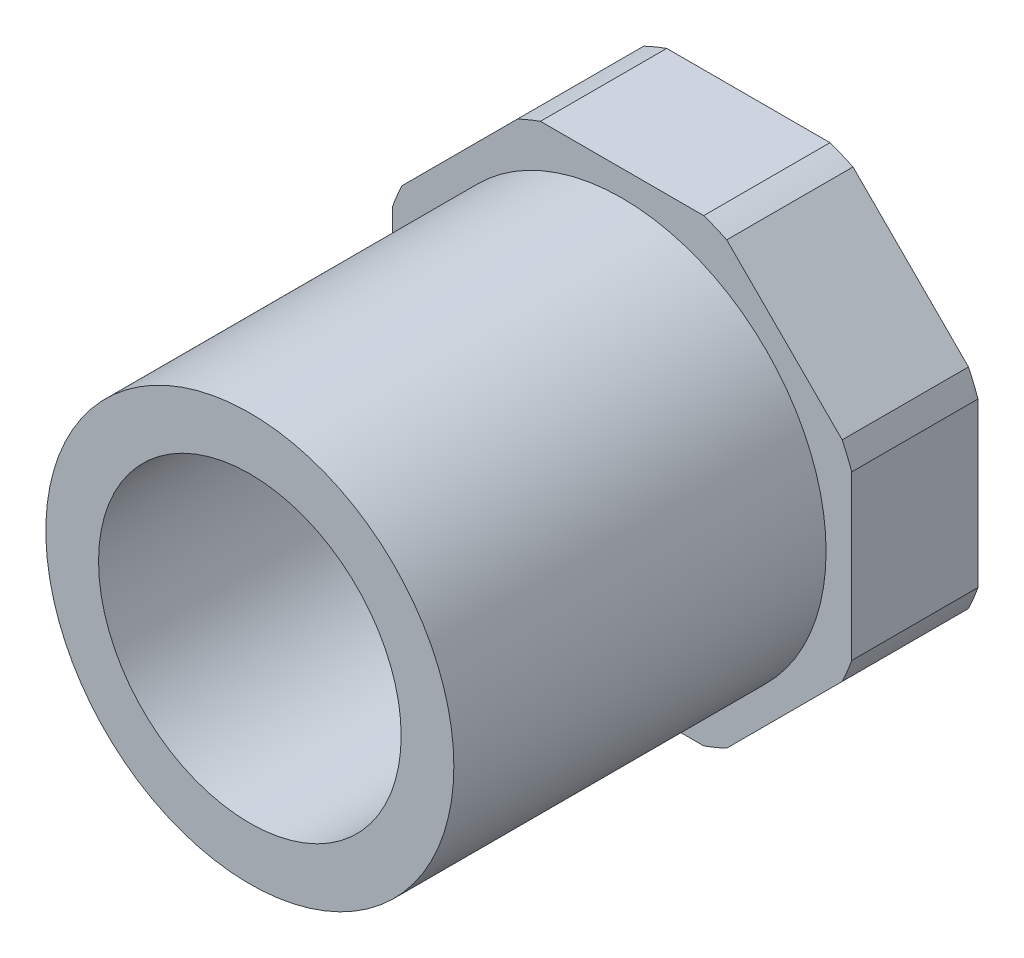
ISO-10303-21;
HEADER;
FILE_DESCRIPTION(('STEP AP214'),'2;1');
FILE_NAME('part.step','',(''),(''),'','','');
FILE_SCHEMA(('AUTOMOTIVE_DESIGN { 1 0 10303 214 1 1 1 1 }'));
ENDSEC;
DATA;
#1=APPLICATION_CONTEXT('core data for automotive mechanical design processes');
#2=APPLICATION_PROTOCOL_DEFINITION('international standard','automotive_design',2000,#1);
#3=PRODUCT_CONTEXT('',#1,'mechanical');
#4=PRODUCT('Part','Part','',(#3));
#5=PRODUCT_RELATED_PRODUCT_CATEGORY('part','',(#4));
#6=PRODUCT_DEFINITION_FORMATION('','',#4);
#7=PRODUCT_DEFINITION_CONTEXT('part definition',#1,'design');
#8=PRODUCT_DEFINITION('design','',#6,#7);
#9=PRODUCT_DEFINITION_SHAPE('','',#8);
#10=(LENGTH_UNIT() NAMED_UNIT(*) SI_UNIT(.MILLI.,.METRE.));
#11=(NAMED_UNIT(*) PLANE_ANGLE_UNIT() SI_UNIT($,.RADIAN.));
#12=(NAMED_UNIT(*) SI_UNIT($,.STERADIAN.) SOLID_ANGLE_UNIT());
#13=UNCERTAINTY_MEASURE_WITH_UNIT(LENGTH_MEASURE(1.E-05),#10,'distance_accuracy_value','');
#14=(GEOMETRIC_REPRESENTATION_CONTEXT(3) GLOBAL_UNCERTAINTY_ASSIGNED_CONTEXT((#13)) GLOBAL_UNIT_ASSIGNED_CONTEXT((#10,
#11,#12)) REPRESENTATION_CONTEXT('',''));
#15=CARTESIAN_POINT('',(0.,0.,0.));
#16=DIRECTION('',(0.,0.,1.));
#17=DIRECTION('',(1.,0.,0.));
#18=AXIS2_PLACEMENT_3D('',#15,#16,#17);
#19=CARTESIAN_POINT('',(0.,0.,13.096875));
#20=DIRECTION('',(0.,0.,1.));
#21=DIRECTION('',(1.,0.,0.));
#22=AXIS2_PLACEMENT_3D('',#19,#20,#21);
#23=CYLINDRICAL_SURFACE('',#22,10.7188);
#24=CARTESIAN_POINT('',(0.,0.,13.096875));
#25=DIRECTION('',(0.,0.,1.));
#26=DIRECTION('',(1.,0.,0.));
#27=AXIS2_PLACEMENT_3D('',#24,#25,#26);
#28=CIRCLE('',#27,10.7188);
#29=CARTESIAN_POINT('',(10.7188,0.,13.096875));
#30=VERTEX_POINT('',#29);
#31=EDGE_CURVE('E178',#30,#30,#28,.T.);
#32=ORIENTED_EDGE('',*,*,#31,.F.);
#33=EDGE_LOOP('',(#32));
#34=FACE_BOUND('',#33,.T.);
#35=CARTESIAN_POINT('',(0.,0.,-6.461125));
#36=DIRECTION('',(0.,0.,-1.));
#37=DIRECTION('',(0.,1.,0.));
#38=AXIS2_PLACEMENT_3D('',#35,#36,#37);
#39=CIRCLE('',#38,10.7188);
#40=CARTESIAN_POINT('',(0.,10.7188,-6.461125));
#41=VERTEX_POINT('',#40);
#42=EDGE_CURVE('E236',#41,#41,#39,.T.);
#43=ORIENTED_EDGE('',*,*,#42,.F.);
#44=EDGE_LOOP('',(#43));
#45=FACE_BOUND('',#44,.T.);
#46=ADVANCED_FACE('F33',(#34,#45),#23,.T.);
#47=CARTESIAN_POINT('',(0.,0.,14.2399258000002));
#48=DIRECTION('',(0.,0.,1.));
#49=DIRECTION('',(0.,-1.,0.));
#50=AXIS2_PLACEMENT_3D('',#47,#48,#49);
#51=SPHERICAL_SURFACE('',#50,20.7010508000002);
#52=CARTESIAN_POINT('',(0.,0.,-4.87362500000002));
#53=DIRECTION('',(0.,0.,1.));
#54=DIRECTION('',(1.,0.,0.));
#55=AXIS2_PLACEMENT_3D('',#52,#53,#54);
#56=CIRCLE('',#55,7.95019999999999);
#57=CARTESIAN_POINT('',(7.95019999999999,0.,-4.87362500000002));
#58=VERTEX_POINT('',#57);
#59=EDGE_CURVE('E183',#58,#58,#56,.T.);
#60=ORIENTED_EDGE('',*,*,#59,.T.);
#61=EDGE_LOOP('',(#60));
#62=FACE_BOUND('',#61,.T.);
#63=ADVANCED_FACE('F35',(#62),#51,.F.);
#64=CARTESIAN_POINT('',(0.,0.,13.096875));
#65=DIRECTION('',(0.,0.,1.));
#66=DIRECTION('',(1.,0.,0.));
#67=AXIS2_PLACEMENT_3D('',#64,#65,#66);
#68=CYLINDRICAL_SURFACE('',#67,7.95019999999999);
#69=CARTESIAN_POINT('',(0.,0.,13.096875));
#70=DIRECTION('',(0.,0.,1.));
#71=DIRECTION('',(1.,0.,0.));
#72=AXIS2_PLACEMENT_3D('',#69,#70,#71);
#73=CIRCLE('',#72,7.95019999999999);
#74=CARTESIAN_POINT('',(7.95019999999999,0.,13.096875));
#75=VERTEX_POINT('',#74);
#76=EDGE_CURVE('E181',#75,#75,#73,.T.);
#77=ORIENTED_EDGE('',*,*,#76,.T.);
#78=EDGE_LOOP('',(#77));
#79=FACE_BOUND('',#78,.T.);
#80=ORIENTED_EDGE('',*,*,#59,.F.);
#81=EDGE_LOOP('',(#80));
#82=FACE_BOUND('',#81,.T.);
#83=ADVANCED_FACE('F331',(#79,#82),#68,.F.);
#84=CARTESIAN_POINT('',(0.,-10.7188,13.096875));
#85=DIRECTION('',(0.,0.,1.));
#86=DIRECTION('',(1.,0.,0.));
#87=AXIS2_PLACEMENT_3D('',#84,#85,#86);
#88=PLANE('',#87);
#89=ORIENTED_EDGE('',*,*,#31,.T.);
#90=EDGE_LOOP('',(#89));
#91=FACE_BOUND('',#90,.T.);
#92=ORIENTED_EDGE('',*,*,#76,.F.);
#93=EDGE_LOOP('',(#92));
#94=FACE_BOUND('',#93,.T.);
#95=ADVANCED_FACE('F337',(#91,#94),#88,.T.);
#96=CARTESIAN_POINT('',(-12.065,4.99748663003139,-6.461125));
#97=DIRECTION('',(-0.707106781186547,0.707106781186548,0.));
#98=DIRECTION('',(-0.707106781186548,-0.707106781186547,0.));
#99=AXIS2_PLACEMENT_3D('',#96,#97,#98);
#100=PLANE('',#99);
#101=DIRECTION('',(0.,0.,-1.));
#102=VECTOR('',#101,1.);
#103=CARTESIAN_POINT('',(-5.49764931005171,11.5648373199796,-6.461125));
#104=LINE('',#103,#102);
#105=CARTESIAN_POINT('',(-5.49764931005171,11.5648373199796,-13.096875));
#106=VERTEX_POINT('',#105);
#107=CARTESIAN_POINT('',(-5.49764931005171,11.5648373199796,-6.461125));
#108=VERTEX_POINT('',#107);
#109=EDGE_CURVE('E255',#106,#108,#104,.F.);
#110=ORIENTED_EDGE('',*,*,#109,.F.);
#111=DIRECTION('',(0.707106781186548,0.707106781186547,0.));
#112=VECTOR('',#111,1.);
#113=CARTESIAN_POINT('',(-12.065,4.99748663003139,-13.096875));
#114=LINE('',#113,#112);
#115=CARTESIAN_POINT('',(-11.5648373199796,5.49764931005173,-13.096875));
#116=VERTEX_POINT('',#115);
#117=EDGE_CURVE('E234',#116,#106,#114,.T.);
#118=ORIENTED_EDGE('',*,*,#117,.F.);
#119=DIRECTION('',(0.,0.,-1.));
#120=VECTOR('',#119,1.);
#121=CARTESIAN_POINT('',(-11.5648373199796,5.49764931005173,-6.461125));
#122=LINE('',#121,#120);
#123=CARTESIAN_POINT('',(-11.5648373199796,5.49764931005173,-6.461125));
#124=VERTEX_POINT('',#123);
#125=EDGE_CURVE('E151',#124,#116,#122,.T.);
#126=ORIENTED_EDGE('',*,*,#125,.F.);
#127=DIRECTION('',(0.707106781186548,0.707106781186547,0.));
#128=VECTOR('',#127,1.);
#129=CARTESIAN_POINT('',(-12.065,4.99748663003139,-6.461125));
#130=LINE('',#129,#128);
#131=EDGE_CURVE('E168',#124,#108,#130,.T.);
#132=ORIENTED_EDGE('',*,*,#131,.T.);
#133=EDGE_LOOP('',(#110,#118,#126,#132));
#134=FACE_BOUND('',#133,.T.);
#135=ADVANCED_FACE('F315',(#134),#100,.T.);
#136=CARTESIAN_POINT('',(-12.065,-4.99748663003137,-6.461125));
#137=DIRECTION('',(-1.,0.,0.));
#138=DIRECTION('',(0.,-1.,0.));
#139=AXIS2_PLACEMENT_3D('',#136,#137,#138);
#140=PLANE('',#139);
#141=DIRECTION('',(0.,0.,-1.));
#142=VECTOR('',#141,1.);
#143=CARTESIAN_POINT('',(-12.065,4.29014978455376,-6.461125));
#144=LINE('',#143,#142);
#145=CARTESIAN_POINT('',(-12.065,4.29014978455375,-13.096875));
#146=VERTEX_POINT('',#145);
#147=CARTESIAN_POINT('',(-12.065,4.29014978455375,-6.461125));
#148=VERTEX_POINT('',#147);
#149=EDGE_CURVE('E148',#146,#148,#144,.F.);
#150=ORIENTED_EDGE('',*,*,#149,.F.);
#151=DIRECTION('',(0.,1.,0.));
#152=VECTOR('',#151,1.);
#153=CARTESIAN_POINT('',(-12.065,-4.99748663003137,-13.096875));
#154=LINE('',#153,#152);
#155=CARTESIAN_POINT('',(-12.065,-4.29014978455375,-13.096875));
#156=VERTEX_POINT('',#155);
#157=EDGE_CURVE('E162',#156,#146,#154,.T.);
#158=ORIENTED_EDGE('',*,*,#157,.F.);
#159=DIRECTION('',(0.,0.,-1.));
#160=VECTOR('',#159,1.);
#161=CARTESIAN_POINT('',(-12.065,-4.29014978455375,-6.461125));
#162=LINE('',#161,#160);
#163=CARTESIAN_POINT('',(-12.065,-4.29014978455375,-6.461125));
#164=VERTEX_POINT('',#163);
#165=EDGE_CURVE('E48',#164,#156,#162,.T.);
#166=ORIENTED_EDGE('',*,*,#165,.F.);
#167=DIRECTION('',(0.,1.,0.));
#168=VECTOR('',#167,1.);
#169=CARTESIAN_POINT('',(-12.065,-4.99748663003137,-6.461125));
#170=LINE('',#169,#168);
#171=EDGE_CURVE('E164',#164,#148,#170,.T.);
#172=ORIENTED_EDGE('',*,*,#171,.T.);
#173=EDGE_LOOP('',(#150,#158,#166,#172));
#174=FACE_BOUND('',#173,.T.);
#175=ADVANCED_FACE('F161',(#174),#140,.T.);
#176=CARTESIAN_POINT('',(-4.99748663003138,-12.065,-6.461125));
#177=DIRECTION('',(-0.707106781186548,-0.707106781186547,0.));
#178=DIRECTION('',(0.707106781186547,-0.707106781186548,0.));
#179=AXIS2_PLACEMENT_3D('',#176,#177,#178);
#180=PLANE('',#179);
#181=DIRECTION('',(0.,0.,-1.));
#182=VECTOR('',#181,1.);
#183=CARTESIAN_POINT('',(-11.5648373199797,-5.4976493100517,-6.461125));
#184=LINE('',#183,#182);
#185=CARTESIAN_POINT('',(-11.5648373199797,-5.49764931005169,-13.096875));
#186=VERTEX_POINT('',#185);
#187=CARTESIAN_POINT('',(-11.5648373199797,-5.49764931005169,-6.461125));
#188=VERTEX_POINT('',#187);
#189=EDGE_CURVE('E259',#186,#188,#184,.F.);
#190=ORIENTED_EDGE('',*,*,#189,.F.);
#191=DIRECTION('',(-0.707106781186547,0.707106781186548,0.));
#192=VECTOR('',#191,1.);
#193=CARTESIAN_POINT('',(-4.99748663003138,-12.065,-13.096875));
#194=LINE('',#193,#192);
#195=CARTESIAN_POINT('',(-5.4976493100517,-11.5648373199796,-13.096875));
#196=VERTEX_POINT('',#195);
#197=EDGE_CURVE('E169',#196,#186,#194,.T.);
#198=ORIENTED_EDGE('',*,*,#197,.F.);
#199=DIRECTION('',(0.,0.,-1.));
#200=VECTOR('',#199,1.);
#201=CARTESIAN_POINT('',(-5.4976493100517,-11.5648373199796,-6.461125));
#202=LINE('',#201,#200);
#203=CARTESIAN_POINT('',(-5.4976493100517,-11.5648373199796,-6.461125));
#204=VERTEX_POINT('',#203);
#205=EDGE_CURVE('E56',#204,#196,#202,.T.);
#206=ORIENTED_EDGE('',*,*,#205,.F.);
#207=DIRECTION('',(-0.707106781186547,0.707106781186548,0.));
#208=VECTOR('',#207,1.);
#209=CARTESIAN_POINT('',(-4.99748663003138,-12.065,-6.461125));
#210=LINE('',#209,#208);
#211=EDGE_CURVE('E238',#204,#188,#210,.T.);
#212=ORIENTED_EDGE('',*,*,#211,.T.);
#213=EDGE_LOOP('',(#190,#198,#206,#212));
#214=FACE_BOUND('',#213,.T.);
#215=ADVANCED_FACE('F364',(#214),#180,.T.);
#216=CARTESIAN_POINT('',(4.99748663003136,-12.065,-6.461125));
#217=DIRECTION('',(0.,-1.,0.));
#218=DIRECTION('',(1.,0.,0.));
#219=AXIS2_PLACEMENT_3D('',#216,#217,#218);
#220=PLANE('',#219);
#221=DIRECTION('',(0.,0.,-1.));
#222=VECTOR('',#221,1.);
#223=CARTESIAN_POINT('',(-4.29014978455377,-12.065,-6.461125));
#224=LINE('',#223,#222);
#225=CARTESIAN_POINT('',(-4.29014978455375,-12.065,-13.096875));
#226=VERTEX_POINT('',#225);
#227=CARTESIAN_POINT('',(-4.29014978455376,-12.065,-6.461125));
#228=VERTEX_POINT('',#227);
#229=EDGE_CURVE('E208',#226,#228,#224,.F.);
#230=ORIENTED_EDGE('',*,*,#229,.F.);
#231=DIRECTION('',(-1.,0.,0.));
#232=VECTOR('',#231,1.);
#233=CARTESIAN_POINT('',(4.99748663003136,-12.065,-13.096875));
#234=LINE('',#233,#232);
#235=CARTESIAN_POINT('',(4.29014978455375,-12.065,-13.096875));
#236=VERTEX_POINT('',#235);
#237=EDGE_CURVE('E174',#236,#226,#234,.T.);
#238=ORIENTED_EDGE('',*,*,#237,.F.);
#239=DIRECTION('',(0.,0.,-1.));
#240=VECTOR('',#239,1.);
#241=CARTESIAN_POINT('',(4.29014978455376,-12.065,-6.461125));
#242=LINE('',#241,#240);
#243=CARTESIAN_POINT('',(4.29014978455375,-12.065,-6.461125));
#244=VERTEX_POINT('',#243);
#245=EDGE_CURVE('E219',#244,#236,#242,.T.);
#246=ORIENTED_EDGE('',*,*,#245,.F.);
#247=DIRECTION('',(-1.,0.,0.));
#248=VECTOR('',#247,1.);
#249=CARTESIAN_POINT('',(4.99748663003136,-12.065,-6.461125));
#250=LINE('',#249,#248);
#251=EDGE_CURVE('E218',#244,#228,#250,.T.);
#252=ORIENTED_EDGE('',*,*,#251,.T.);
#253=EDGE_LOOP('',(#230,#238,#246,#252));
#254=FACE_BOUND('',#253,.T.);
#255=ADVANCED_FACE('F215',(#254),#220,.T.);
#256=CARTESIAN_POINT('',(12.065,-4.99748663003137,-6.461125));
#257=DIRECTION('',(0.707106781186547,-0.707106781186548,0.));
#258=DIRECTION('',(0.707106781186548,0.707106781186547,0.));
#259=AXIS2_PLACEMENT_3D('',#256,#257,#258);
#260=PLANE('',#259);
#261=DIRECTION('',(0.,0.,-1.));
#262=VECTOR('',#261,1.);
#263=CARTESIAN_POINT('',(5.49764931005168,-11.5648373199797,-6.461125));
#264=LINE('',#263,#262);
#265=CARTESIAN_POINT('',(5.49764931005168,-11.5648373199797,-13.096875));
#266=VERTEX_POINT('',#265);
#267=CARTESIAN_POINT('',(5.49764931005168,-11.5648373199797,-6.461125));
#268=VERTEX_POINT('',#267);
#269=EDGE_CURVE('E263',#266,#268,#264,.F.);
#270=ORIENTED_EDGE('',*,*,#269,.F.);
#271=DIRECTION('',(-0.707106781186548,-0.707106781186547,0.));
#272=VECTOR('',#271,1.);
#273=CARTESIAN_POINT('',(12.065,-4.99748663003137,-13.096875));
#274=LINE('',#273,#272);
#275=CARTESIAN_POINT('',(11.5648373199797,-5.4976493100517,-13.096875));
#276=VERTEX_POINT('',#275);
#277=EDGE_CURVE('E222',#276,#266,#274,.T.);
#278=ORIENTED_EDGE('',*,*,#277,.F.);
#279=DIRECTION('',(0.,0.,-1.));
#280=VECTOR('',#279,1.);
#281=CARTESIAN_POINT('',(11.5648373199797,-5.4976493100517,-6.461125));
#282=LINE('',#281,#280);
#283=CARTESIAN_POINT('',(11.5648373199796,-5.4976493100517,-6.461125));
#284=VERTEX_POINT('',#283);
#285=EDGE_CURVE('E265',#284,#276,#282,.T.);
#286=ORIENTED_EDGE('',*,*,#285,.F.);
#287=DIRECTION('',(-0.707106781186548,-0.707106781186547,0.));
#288=VECTOR('',#287,1.);
#289=CARTESIAN_POINT('',(12.065,-4.99748663003137,-6.461125));
#290=LINE('',#289,#288);
#291=EDGE_CURVE('E242',#284,#268,#290,.T.);
#292=ORIENTED_EDGE('',*,*,#291,.T.);
#293=EDGE_LOOP('',(#270,#278,#286,#292));
#294=FACE_BOUND('',#293,.T.);
#295=ADVANCED_FACE('F378',(#294),#260,.T.);
#296=CARTESIAN_POINT('',(12.065,4.99748663003136,-6.461125));
#297=DIRECTION('',(1.,0.,0.));
#298=DIRECTION('',(0.,1.,0.));
#299=AXIS2_PLACEMENT_3D('',#296,#297,#298);
#300=PLANE('',#299);
#301=DIRECTION('',(0.,0.,-1.));
#302=VECTOR('',#301,1.);
#303=CARTESIAN_POINT('',(12.065,-4.29014978455375,-6.461125));
#304=LINE('',#303,#302);
#305=CARTESIAN_POINT('',(12.065,-4.29014978455375,-13.096875));
#306=VERTEX_POINT('',#305);
#307=CARTESIAN_POINT('',(12.065,-4.29014978455375,-6.461125));
#308=VERTEX_POINT('',#307);
#309=EDGE_CURVE('E267',#306,#308,#304,.F.);
#310=ORIENTED_EDGE('',*,*,#309,.F.);
#311=DIRECTION('',(0.,-1.,0.));
#312=VECTOR('',#311,1.);
#313=CARTESIAN_POINT('',(12.065,4.99748663003136,-13.096875));
#314=LINE('',#313,#312);
#315=CARTESIAN_POINT('',(12.065,4.29014978455374,-13.096875));
#316=VERTEX_POINT('',#315);
#317=EDGE_CURVE('E223',#316,#306,#314,.T.);
#318=ORIENTED_EDGE('',*,*,#317,.F.);
#319=DIRECTION('',(0.,0.,-1.));
#320=VECTOR('',#319,1.);
#321=CARTESIAN_POINT('',(12.065,4.29014978455374,-6.461125));
#322=LINE('',#321,#320);
#323=CARTESIAN_POINT('',(12.065,4.29014978455374,-6.461125));
#324=VERTEX_POINT('',#323);
#325=EDGE_CURVE('E269',#324,#316,#322,.T.);
#326=ORIENTED_EDGE('',*,*,#325,.F.);
#327=DIRECTION('',(0.,-1.,0.));
#328=VECTOR('',#327,1.);
#329=CARTESIAN_POINT('',(12.065,4.99748663003136,-6.461125));
#330=LINE('',#329,#328);
#331=EDGE_CURVE('E245',#324,#308,#330,.T.);
#332=ORIENTED_EDGE('',*,*,#331,.T.);
#333=EDGE_LOOP('',(#310,#318,#326,#332));
#334=FACE_BOUND('',#333,.T.);
#335=ADVANCED_FACE('F305',(#334),#300,.T.);
#336=CARTESIAN_POINT('',(4.99748663003136,12.065,-6.461125));
#337=DIRECTION('',(0.707106781186548,0.707106781186547,0.));
#338=DIRECTION('',(-0.707106781186547,0.707106781186548,0.));
#339=AXIS2_PLACEMENT_3D('',#336,#337,#338);
#340=PLANE('',#339);
#341=DIRECTION('',(0.,0.,-1.));
#342=VECTOR('',#341,1.);
#343=CARTESIAN_POINT('',(11.5648373199797,5.49764931005169,-6.461125));
#344=LINE('',#343,#342);
#345=CARTESIAN_POINT('',(11.5648373199797,5.49764931005169,-13.096875));
#346=VERTEX_POINT('',#345);
#347=CARTESIAN_POINT('',(11.5648373199797,5.49764931005169,-6.461125));
#348=VERTEX_POINT('',#347);
#349=EDGE_CURVE('E271',#346,#348,#344,.F.);
#350=ORIENTED_EDGE('',*,*,#349,.F.);
#351=DIRECTION('',(0.707106781186547,-0.707106781186548,0.));
#352=VECTOR('',#351,1.);
#353=CARTESIAN_POINT('',(4.99748663003136,12.065,-13.096875));
#354=LINE('',#353,#352);
#355=CARTESIAN_POINT('',(5.49764931005171,11.5648373199796,-13.096875));
#356=VERTEX_POINT('',#355);
#357=EDGE_CURVE('E228',#356,#346,#354,.T.);
#358=ORIENTED_EDGE('',*,*,#357,.F.);
#359=DIRECTION('',(0.,0.,-1.));
#360=VECTOR('',#359,1.);
#361=CARTESIAN_POINT('',(5.49764931005171,11.5648373199796,-6.461125));
#362=LINE('',#361,#360);
#363=CARTESIAN_POINT('',(5.49764931005171,11.5648373199796,-6.461125));
#364=VERTEX_POINT('',#363);
#365=EDGE_CURVE('E273',#364,#356,#362,.T.);
#366=ORIENTED_EDGE('',*,*,#365,.F.);
#367=DIRECTION('',(0.707106781186547,-0.707106781186548,0.));
#368=VECTOR('',#367,1.);
#369=CARTESIAN_POINT('',(4.99748663003136,12.065,-6.461125));
#370=LINE('',#369,#368);
#371=EDGE_CURVE('E248',#364,#348,#370,.T.);
#372=ORIENTED_EDGE('',*,*,#371,.T.);
#373=EDGE_LOOP('',(#350,#358,#366,#372));
#374=FACE_BOUND('',#373,.T.);
#375=ADVANCED_FACE('F300',(#374),#340,.T.);
#376=CARTESIAN_POINT('',(-4.99748663003136,12.065,-6.461125));
#377=DIRECTION('',(0.,1.,0.));
#378=DIRECTION('',(-1.,0.,0.));
#379=AXIS2_PLACEMENT_3D('',#376,#377,#378);
#380=PLANE('',#379);
#381=DIRECTION('',(0.,0.,-1.));
#382=VECTOR('',#381,1.);
#383=CARTESIAN_POINT('',(4.29014978455372,12.065,-6.461125));
#384=LINE('',#383,#382);
#385=CARTESIAN_POINT('',(4.29014978455371,12.065,-13.096875));
#386=VERTEX_POINT('',#385);
#387=CARTESIAN_POINT('',(4.29014978455371,12.065,-6.461125));
#388=VERTEX_POINT('',#387);
#389=EDGE_CURVE('E275',#386,#388,#384,.F.);
#390=ORIENTED_EDGE('',*,*,#389,.F.);
#391=DIRECTION('',(1.,0.,0.));
#392=VECTOR('',#391,1.);
#393=CARTESIAN_POINT('',(-4.99748663003136,12.065,-13.096875));
#394=LINE('',#393,#392);
#395=CARTESIAN_POINT('',(-4.2901497845537,12.065,-13.096875));
#396=VERTEX_POINT('',#395);
#397=EDGE_CURVE('E231',#396,#386,#394,.T.);
#398=ORIENTED_EDGE('',*,*,#397,.F.);
#399=DIRECTION('',(0.,0.,-1.));
#400=VECTOR('',#399,1.);
#401=CARTESIAN_POINT('',(-4.2901497845537,12.065,-6.461125));
#402=LINE('',#401,#400);
#403=CARTESIAN_POINT('',(-4.29014978455369,12.065,-6.461125));
#404=VERTEX_POINT('',#403);
#405=EDGE_CURVE('E277',#404,#396,#402,.T.);
#406=ORIENTED_EDGE('',*,*,#405,.F.);
#407=DIRECTION('',(1.,0.,0.));
#408=VECTOR('',#407,1.);
#409=CARTESIAN_POINT('',(-4.99748663003136,12.065,-6.461125));
#410=LINE('',#409,#408);
#411=EDGE_CURVE('E172',#404,#388,#410,.T.);
#412=ORIENTED_EDGE('',*,*,#411,.T.);
#413=EDGE_LOOP('',(#390,#398,#406,#412));
#414=FACE_BOUND('',#413,.T.);
#415=ADVANCED_FACE('F311',(#414),#380,.T.);
#416=CARTESIAN_POINT('',(0.,0.,-6.461125));
#417=DIRECTION('',(0.,0.,-1.));
#418=DIRECTION('',(-1.,0.,0.));
#419=AXIS2_PLACEMENT_3D('',#416,#417,#418);
#420=PLANE('',#419);
#421=ORIENTED_EDGE('',*,*,#42,.T.);
#422=EDGE_LOOP('',(#421));
#423=FACE_BOUND('',#422,.T.);
#424=ORIENTED_EDGE('',*,*,#171,.F.);
#425=CARTESIAN_POINT('',(0.,0.,-6.461125));
#426=DIRECTION('',(0.,0.,-1.));
#427=DIRECTION('',(-1.,0.,0.));
#428=AXIS2_PLACEMENT_3D('',#425,#426,#427);
#429=CIRCLE('',#428,12.8050618965277);
#430=EDGE_CURVE('E156',#188,#164,#429,.T.);
#431=ORIENTED_EDGE('',*,*,#430,.F.);
#432=ORIENTED_EDGE('',*,*,#211,.F.);
#433=EDGE_CURVE('E282',#228,#204,#429,.T.);
#434=ORIENTED_EDGE('',*,*,#433,.F.);
#435=ORIENTED_EDGE('',*,*,#251,.F.);
#436=EDGE_CURVE('E284',#268,#244,#429,.T.);
#437=ORIENTED_EDGE('',*,*,#436,.F.);
#438=ORIENTED_EDGE('',*,*,#291,.F.);
#439=EDGE_CURVE('E285',#308,#284,#429,.T.);
#440=ORIENTED_EDGE('',*,*,#439,.F.);
#441=ORIENTED_EDGE('',*,*,#331,.F.);
#442=EDGE_CURVE('E287',#348,#324,#429,.T.);
#443=ORIENTED_EDGE('',*,*,#442,.F.);
#444=ORIENTED_EDGE('',*,*,#371,.F.);
#445=EDGE_CURVE('E281',#388,#364,#429,.T.);
#446=ORIENTED_EDGE('',*,*,#445,.F.);
#447=ORIENTED_EDGE('',*,*,#411,.F.);
#448=EDGE_CURVE('E280',#108,#404,#429,.T.);
#449=ORIENTED_EDGE('',*,*,#448,.F.);
#450=ORIENTED_EDGE('',*,*,#131,.F.);
#451=EDGE_CURVE('E279',#148,#124,#429,.T.);
#452=ORIENTED_EDGE('',*,*,#451,.F.);
#453=EDGE_LOOP('',(#424,#431,#432,#434,#435,#437,#438,#440,#441,#443,#444,#446,#447,#449,#450,#452));
#454=FACE_BOUND('',#453,.T.);
#455=ADVANCED_FACE('F301',(#423,#454),#420,.F.);
#456=CARTESIAN_POINT('',(0.,0.,-13.096875));
#457=DIRECTION('',(0.,0.,-1.));
#458=DIRECTION('',(-1.,0.,0.));
#459=AXIS2_PLACEMENT_3D('',#456,#457,#458);
#460=PLANE('',#459);
#461=CARTESIAN_POINT('',(0.,0.,-13.096875));
#462=DIRECTION('',(0.,0.,-1.));
#463=DIRECTION('',(-1.,0.,0.));
#464=AXIS2_PLACEMENT_3D('',#461,#462,#463);
#465=CIRCLE('',#464,12.8050618965277);
#466=EDGE_CURVE('E11',#156,#186,#465,.F.);
#467=ORIENTED_EDGE('',*,*,#466,.F.);
#468=ORIENTED_EDGE('',*,*,#157,.T.);
#469=CARTESIAN_POINT('',(0.,0.,-13.096875));
#470=DIRECTION('',(0.,0.,-1.));
#471=DIRECTION('',(-1.,0.,0.));
#472=AXIS2_PLACEMENT_3D('',#469,#470,#471);
#473=CIRCLE('',#472,12.8050618965277);
#474=EDGE_CURVE('E145',#146,#116,#473,.T.);
#475=ORIENTED_EDGE('',*,*,#474,.T.);
#476=ORIENTED_EDGE('',*,*,#117,.T.);
#477=EDGE_CURVE('E42',#396,#106,#465,.F.);
#478=ORIENTED_EDGE('',*,*,#477,.F.);
#479=ORIENTED_EDGE('',*,*,#397,.T.);
#480=EDGE_CURVE('E187',#356,#386,#465,.F.);
#481=ORIENTED_EDGE('',*,*,#480,.F.);
#482=ORIENTED_EDGE('',*,*,#357,.T.);
#483=EDGE_CURVE('E191',#316,#346,#465,.F.);
#484=ORIENTED_EDGE('',*,*,#483,.F.);
#485=ORIENTED_EDGE('',*,*,#317,.T.);
#486=EDGE_CURVE('E195',#276,#306,#465,.F.);
#487=ORIENTED_EDGE('',*,*,#486,.F.);
#488=ORIENTED_EDGE('',*,*,#277,.T.);
#489=EDGE_CURVE('E199',#236,#266,#465,.F.);
#490=ORIENTED_EDGE('',*,*,#489,.F.);
#491=ORIENTED_EDGE('',*,*,#237,.T.);
#492=EDGE_CURVE('E41',#196,#226,#465,.F.);
#493=ORIENTED_EDGE('',*,*,#492,.F.);
#494=ORIENTED_EDGE('',*,*,#197,.T.);
#495=EDGE_LOOP('',(#467,#468,#475,#476,#478,#479,#481,#482,#484,#485,#487,#488,#490,#491,#493,#494));
#496=FACE_BOUND('',#495,.T.);
#497=ADVANCED_FACE('F166',(#496),#460,.T.);
#498=CARTESIAN_POINT('',(0.,0.,-6.461125));
#499=DIRECTION('',(0.,0.,-1.));
#500=DIRECTION('',(-1.,0.,0.));
#501=AXIS2_PLACEMENT_3D('',#498,#499,#500);
#502=CYLINDRICAL_SURFACE('',#501,12.8050618965277);
#503=ORIENTED_EDGE('',*,*,#125,.T.);
#504=ORIENTED_EDGE('',*,*,#474,.F.);
#505=ORIENTED_EDGE('',*,*,#149,.T.);
#506=ORIENTED_EDGE('',*,*,#451,.T.);
#507=EDGE_LOOP('',(#503,#504,#505,#506));
#508=FACE_BOUND('',#507,.T.);
#509=ADVANCED_FACE('F147',(#508),#502,.T.);
#510=ORIENTED_EDGE('',*,*,#109,.T.);
#511=ORIENTED_EDGE('',*,*,#448,.T.);
#512=ORIENTED_EDGE('',*,*,#405,.T.);
#513=ORIENTED_EDGE('',*,*,#477,.T.);
#514=EDGE_LOOP('',(#510,#511,#512,#513));
#515=FACE_BOUND('',#514,.T.);
#516=ADVANCED_FACE('F316',(#515),#502,.T.);
#517=ORIENTED_EDGE('',*,*,#365,.T.);
#518=ORIENTED_EDGE('',*,*,#480,.T.);
#519=ORIENTED_EDGE('',*,*,#389,.T.);
#520=ORIENTED_EDGE('',*,*,#445,.T.);
#521=EDGE_LOOP('',(#517,#518,#519,#520));
#522=FACE_BOUND('',#521,.T.);
#523=ADVANCED_FACE('F294',(#522),#502,.T.);
#524=ORIENTED_EDGE('',*,*,#325,.T.);
#525=ORIENTED_EDGE('',*,*,#483,.T.);
#526=ORIENTED_EDGE('',*,*,#349,.T.);
#527=ORIENTED_EDGE('',*,*,#442,.T.);
#528=EDGE_LOOP('',(#524,#525,#526,#527));
#529=FACE_BOUND('',#528,.T.);
#530=ADVANCED_FACE('F307',(#529),#502,.T.);
#531=ORIENTED_EDGE('',*,*,#285,.T.);
#532=ORIENTED_EDGE('',*,*,#486,.T.);
#533=ORIENTED_EDGE('',*,*,#309,.T.);
#534=ORIENTED_EDGE('',*,*,#439,.T.);
#535=EDGE_LOOP('',(#531,#532,#533,#534));
#536=FACE_BOUND('',#535,.T.);
#537=ADVANCED_FACE('F438',(#536),#502,.T.);
#538=ORIENTED_EDGE('',*,*,#245,.T.);
#539=ORIENTED_EDGE('',*,*,#489,.T.);
#540=ORIENTED_EDGE('',*,*,#269,.T.);
#541=ORIENTED_EDGE('',*,*,#436,.T.);
#542=EDGE_LOOP('',(#538,#539,#540,#541));
#543=FACE_BOUND('',#542,.T.);
#544=ADVANCED_FACE('F446',(#543),#502,.T.);
#545=ORIENTED_EDGE('',*,*,#205,.T.);
#546=ORIENTED_EDGE('',*,*,#492,.T.);
#547=ORIENTED_EDGE('',*,*,#229,.T.);
#548=ORIENTED_EDGE('',*,*,#433,.T.);
#549=EDGE_LOOP('',(#545,#546,#547,#548));
#550=FACE_BOUND('',#549,.T.);
#551=ADVANCED_FACE('F207',(#550),#502,.T.);
#552=ORIENTED_EDGE('',*,*,#165,.T.);
#553=ORIENTED_EDGE('',*,*,#466,.T.);
#554=ORIENTED_EDGE('',*,*,#189,.T.);
#555=ORIENTED_EDGE('',*,*,#430,.T.);
#556=EDGE_LOOP('',(#552,#553,#554,#555));
#557=FACE_BOUND('',#556,.T.);
#558=ADVANCED_FACE('F323',(#557),#502,.T.);
#559=CLOSED_SHELL('',(#46,#63,#83,#95,#135,#175,#215,#255,#295,#335,#375,#415,#455,#497,#509,
#516,#523,#530,#537,#544,#551,#558));
#560=MANIFOLD_SOLID_BREP('B2',#559);
#561=ADVANCED_BREP_SHAPE_REPRESENTATION('',(#18,#560),#14);
#562=SHAPE_DEFINITION_REPRESENTATION(#9,#561);
ENDSEC;
END-ISO-10303-21;
